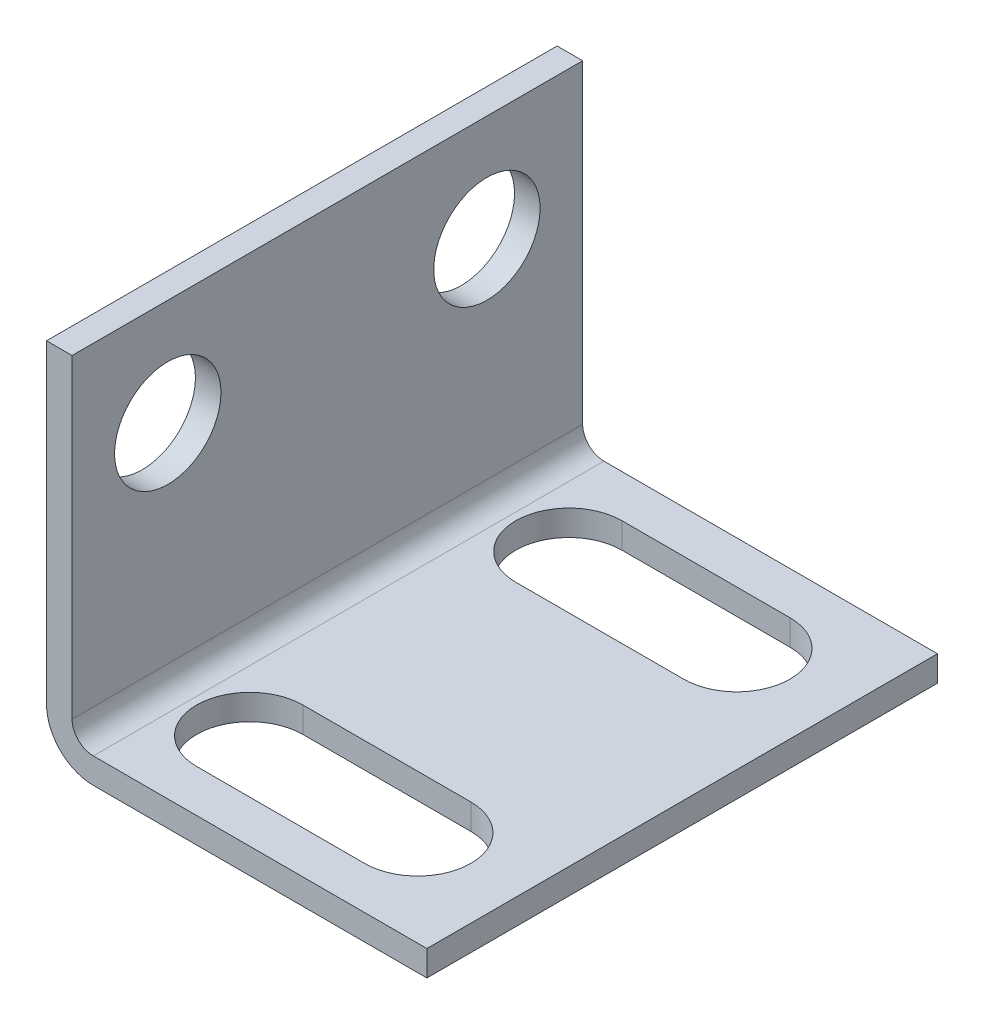
ISO-10303-21;
HEADER;
FILE_DESCRIPTION(('STEP AP214'),'2;1');
FILE_NAME('part.step','',(''),(''),'','','');
FILE_SCHEMA(('AUTOMOTIVE_DESIGN { 1 0 10303 214 1 1 1 1 }'));
ENDSEC;
DATA;
#1=APPLICATION_CONTEXT('core data for automotive mechanical design processes');
#2=APPLICATION_PROTOCOL_DEFINITION('international standard','automotive_design',2000,#1);
#3=PRODUCT_CONTEXT('',#1,'mechanical');
#4=PRODUCT('Part','Part','',(#3));
#5=PRODUCT_RELATED_PRODUCT_CATEGORY('part','',(#4));
#6=PRODUCT_DEFINITION_FORMATION('','',#4);
#7=PRODUCT_DEFINITION_CONTEXT('part definition',#1,'design');
#8=PRODUCT_DEFINITION('design','',#6,#7);
#9=PRODUCT_DEFINITION_SHAPE('','',#8);
#10=(LENGTH_UNIT() NAMED_UNIT(*) SI_UNIT(.MILLI.,.METRE.));
#11=(NAMED_UNIT(*) PLANE_ANGLE_UNIT() SI_UNIT($,.RADIAN.));
#12=(NAMED_UNIT(*) SI_UNIT($,.STERADIAN.) SOLID_ANGLE_UNIT());
#13=UNCERTAINTY_MEASURE_WITH_UNIT(LENGTH_MEASURE(1.E-05),#10,'distance_accuracy_value','');
#14=(GEOMETRIC_REPRESENTATION_CONTEXT(3) GLOBAL_UNCERTAINTY_ASSIGNED_CONTEXT((#13)) GLOBAL_UNIT_ASSIGNED_CONTEXT((#10,
#11,#12)) REPRESENTATION_CONTEXT('',''));
#15=CARTESIAN_POINT('',(0.,0.,0.));
#16=DIRECTION('',(0.,0.,1.));
#17=DIRECTION('',(1.,0.,0.));
#18=AXIS2_PLACEMENT_3D('',#15,#16,#17);
#19=CARTESIAN_POINT('',(1.2,0.,0.));
#20=DIRECTION('',(-1.,0.,0.));
#21=DIRECTION('',(0.,0.,1.));
#22=AXIS2_PLACEMENT_3D('',#19,#20,#21);
#23=PLANE('',#22);
#24=DIRECTION('',(0.,-1.,0.));
#25=VECTOR('',#24,1.);
#26=CARTESIAN_POINT('',(1.2,0.,0.));
#27=LINE('',#26,#25);
#28=CARTESIAN_POINT('',(1.2,17.,0.));
#29=VERTEX_POINT('',#28);
#30=CARTESIAN_POINT('',(1.2,2.2,0.));
#31=VERTEX_POINT('',#30);
#32=EDGE_CURVE('E254',#29,#31,#27,.T.);
#33=ORIENTED_EDGE('',*,*,#32,.T.);
#34=DIRECTION('',(0.,0.,-1.));
#35=VECTOR('',#34,1.);
#36=CARTESIAN_POINT('',(1.2,2.2,0.));
#37=LINE('',#36,#35);
#38=CARTESIAN_POINT('',(1.2,2.2,-24.));
#39=VERTEX_POINT('',#38);
#40=EDGE_CURVE('E272',#31,#39,#37,.T.);
#41=ORIENTED_EDGE('',*,*,#40,.T.);
#42=DIRECTION('',(0.,1.,0.));
#43=VECTOR('',#42,1.);
#44=CARTESIAN_POINT('',(1.2,17.,-24.));
#45=LINE('',#44,#43);
#46=CARTESIAN_POINT('',(1.2,17.,-24.));
#47=VERTEX_POINT('',#46);
#48=EDGE_CURVE('E249',#39,#47,#45,.T.);
#49=ORIENTED_EDGE('',*,*,#48,.T.);
#50=DIRECTION('',(0.,0.,1.));
#51=VECTOR('',#50,1.);
#52=CARTESIAN_POINT('',(1.2,17.,0.));
#53=LINE('',#52,#51);
#54=EDGE_CURVE('E251',#47,#29,#53,.T.);
#55=ORIENTED_EDGE('',*,*,#54,.T.);
#56=EDGE_LOOP('',(#33,#41,#49,#55));
#57=FACE_BOUND('',#56,.T.);
#58=CARTESIAN_POINT('',(1.2,12.,-4.5));
#59=DIRECTION('',(1.,0.,0.));
#60=DIRECTION('',(0.,0.,-1.));
#61=AXIS2_PLACEMENT_3D('',#58,#59,#60);
#62=CIRCLE('',#61,2.5);
#63=CARTESIAN_POINT('',(1.2,12.,-7.));
#64=VERTEX_POINT('',#63);
#65=EDGE_CURVE('E243',#64,#64,#62,.T.);
#66=ORIENTED_EDGE('',*,*,#65,.F.);
#67=EDGE_LOOP('',(#66));
#68=FACE_BOUND('',#67,.T.);
#69=CARTESIAN_POINT('',(1.2,12.,-19.5));
#70=DIRECTION('',(1.,0.,0.));
#71=DIRECTION('',(0.,0.,-1.));
#72=AXIS2_PLACEMENT_3D('',#69,#70,#71);
#73=CIRCLE('',#72,2.5);
#74=CARTESIAN_POINT('',(1.2,12.,-22.));
#75=VERTEX_POINT('',#74);
#76=EDGE_CURVE('E237',#75,#75,#73,.T.);
#77=ORIENTED_EDGE('',*,*,#76,.F.);
#78=EDGE_LOOP('',(#77));
#79=FACE_BOUND('',#78,.T.);
#80=ADVANCED_FACE('F34',(#57,#68,#79),#23,.F.);
#81=CARTESIAN_POINT('',(0.,0.,0.));
#82=DIRECTION('',(-1.,0.,0.));
#83=DIRECTION('',(0.,0.,1.));
#84=AXIS2_PLACEMENT_3D('',#81,#82,#83);
#85=PLANE('',#84);
#86=DIRECTION('',(0.,1.,0.));
#87=VECTOR('',#86,1.);
#88=CARTESIAN_POINT('',(0.,17.,-24.));
#89=LINE('',#88,#87);
#90=CARTESIAN_POINT('',(0.,2.20000000000001,-24.));
#91=VERTEX_POINT('',#90);
#92=CARTESIAN_POINT('',(0.,17.,-24.));
#93=VERTEX_POINT('',#92);
#94=EDGE_CURVE('E246',#91,#93,#89,.T.);
#95=ORIENTED_EDGE('',*,*,#94,.F.);
#96=DIRECTION('',(0.,0.,-1.));
#97=VECTOR('',#96,1.);
#98=CARTESIAN_POINT('',(0.,2.2,0.));
#99=LINE('',#98,#97);
#100=CARTESIAN_POINT('',(0.,2.2,0.));
#101=VERTEX_POINT('',#100);
#102=EDGE_CURVE('E42',#91,#101,#99,.F.);
#103=ORIENTED_EDGE('',*,*,#102,.T.);
#104=DIRECTION('',(0.,-1.,0.));
#105=VECTOR('',#104,1.);
#106=CARTESIAN_POINT('',(0.,0.,0.));
#107=LINE('',#106,#105);
#108=CARTESIAN_POINT('',(0.,17.,0.));
#109=VERTEX_POINT('',#108);
#110=EDGE_CURVE('E252',#109,#101,#107,.T.);
#111=ORIENTED_EDGE('',*,*,#110,.F.);
#112=DIRECTION('',(0.,0.,1.));
#113=VECTOR('',#112,1.);
#114=CARTESIAN_POINT('',(0.,17.,0.));
#115=LINE('',#114,#113);
#116=EDGE_CURVE('E259',#93,#109,#115,.T.);
#117=ORIENTED_EDGE('',*,*,#116,.F.);
#118=EDGE_LOOP('',(#95,#103,#111,#117));
#119=FACE_BOUND('',#118,.T.);
#120=CARTESIAN_POINT('',(0.,12.,-4.5));
#121=DIRECTION('',(1.,0.,0.));
#122=DIRECTION('',(0.,0.,-1.));
#123=AXIS2_PLACEMENT_3D('',#120,#121,#122);
#124=CIRCLE('',#123,2.5);
#125=CARTESIAN_POINT('',(0.,12.,-7.));
#126=VERTEX_POINT('',#125);
#127=EDGE_CURVE('E240',#126,#126,#124,.T.);
#128=ORIENTED_EDGE('',*,*,#127,.T.);
#129=EDGE_LOOP('',(#128));
#130=FACE_BOUND('',#129,.T.);
#131=CARTESIAN_POINT('',(0.,12.,-19.5));
#132=DIRECTION('',(1.,0.,0.));
#133=DIRECTION('',(0.,0.,-1.));
#134=AXIS2_PLACEMENT_3D('',#131,#132,#133);
#135=CIRCLE('',#134,2.5);
#136=CARTESIAN_POINT('',(0.,12.,-22.));
#137=VERTEX_POINT('',#136);
#138=EDGE_CURVE('E236',#137,#137,#135,.T.);
#139=ORIENTED_EDGE('',*,*,#138,.T.);
#140=EDGE_LOOP('',(#139));
#141=FACE_BOUND('',#140,.T.);
#142=ADVANCED_FACE('F310',(#119,#130,#141),#85,.T.);
#143=CARTESIAN_POINT('',(1.2,0.,-24.));
#144=DIRECTION('',(0.,1.,0.));
#145=DIRECTION('',(0.,0.,1.));
#146=AXIS2_PLACEMENT_3D('',#143,#144,#145);
#147=PLANE('',#146);
#148=DIRECTION('',(-1.,0.,0.));
#149=VECTOR('',#148,1.);
#150=CARTESIAN_POINT('',(1.2,0.,0.));
#151=LINE('',#150,#149);
#152=CARTESIAN_POINT('',(17.88,0.,0.));
#153=VERTEX_POINT('',#152);
#154=CARTESIAN_POINT('',(2.2,0.,0.));
#155=VERTEX_POINT('',#154);
#156=EDGE_CURVE('E257',#153,#155,#151,.T.);
#157=ORIENTED_EDGE('',*,*,#156,.T.);
#158=DIRECTION('',(0.,0.,-1.));
#159=VECTOR('',#158,1.);
#160=CARTESIAN_POINT('',(2.2,0.,-24.));
#161=LINE('',#160,#159);
#162=CARTESIAN_POINT('',(2.2,0.,-24.));
#163=VERTEX_POINT('',#162);
#164=EDGE_CURVE('E281',#155,#163,#161,.T.);
#165=ORIENTED_EDGE('',*,*,#164,.T.);
#166=DIRECTION('',(-1.,0.,0.));
#167=VECTOR('',#166,1.);
#168=CARTESIAN_POINT('',(1.2,0.,-24.));
#169=LINE('',#168,#167);
#170=CARTESIAN_POINT('',(17.88,0.,-24.));
#171=VERTEX_POINT('',#170);
#172=EDGE_CURVE('E270',#171,#163,#169,.T.);
#173=ORIENTED_EDGE('',*,*,#172,.F.);
#174=DIRECTION('',(0.,0.,-1.));
#175=VECTOR('',#174,1.);
#176=CARTESIAN_POINT('',(17.88,0.,0.));
#177=LINE('',#176,#175);
#178=EDGE_CURVE('E220',#153,#171,#177,.T.);
#179=ORIENTED_EDGE('',*,*,#178,.F.);
#180=EDGE_LOOP('',(#157,#165,#173,#179));
#181=FACE_BOUND('',#180,.T.);
#182=CARTESIAN_POINT('',(5.05275831629409,0.,-19.5));
#183=DIRECTION('',(0.,1.,0.));
#184=DIRECTION('',(0.,0.,1.));
#185=AXIS2_PLACEMENT_3D('',#182,#183,#184);
#186=CIRCLE('',#185,2.5);
#187=CARTESIAN_POINT('',(5.05275831629409,0.,-22.));
#188=VERTEX_POINT('',#187);
#189=CARTESIAN_POINT('',(5.05275831629409,0.,-17.));
#190=VERTEX_POINT('',#189);
#191=EDGE_CURVE('E165',#188,#190,#186,.T.);
#192=ORIENTED_EDGE('',*,*,#191,.T.);
#193=DIRECTION('',(1.,0.,0.));
#194=VECTOR('',#193,1.);
#195=CARTESIAN_POINT('',(5.05275831629409,0.,-17.));
#196=LINE('',#195,#194);
#197=CARTESIAN_POINT('',(12.9472416837059,0.,-17.));
#198=VERTEX_POINT('',#197);
#199=EDGE_CURVE('E203',#190,#198,#196,.T.);
#200=ORIENTED_EDGE('',*,*,#199,.T.);
#201=CARTESIAN_POINT('',(12.9472416837059,0.,-19.5));
#202=DIRECTION('',(0.,1.,0.));
#203=DIRECTION('',(0.,0.,1.));
#204=AXIS2_PLACEMENT_3D('',#201,#202,#203);
#205=CIRCLE('',#204,2.5);
#206=CARTESIAN_POINT('',(12.9472416837059,0.,-22.));
#207=VERTEX_POINT('',#206);
#208=EDGE_CURVE('E206',#198,#207,#205,.T.);
#209=ORIENTED_EDGE('',*,*,#208,.T.);
#210=DIRECTION('',(-1.,0.,0.));
#211=VECTOR('',#210,1.);
#212=CARTESIAN_POINT('',(5.05275831629409,0.,-22.));
#213=LINE('',#212,#211);
#214=EDGE_CURVE('E193',#207,#188,#213,.T.);
#215=ORIENTED_EDGE('',*,*,#214,.T.);
#216=EDGE_LOOP('',(#192,#200,#209,#215));
#217=FACE_BOUND('',#216,.T.);
#218=CARTESIAN_POINT('',(5.05275831629409,0.,-4.5));
#219=DIRECTION('',(0.,1.,0.));
#220=DIRECTION('',(0.,0.,1.));
#221=AXIS2_PLACEMENT_3D('',#218,#219,#220);
#222=CIRCLE('',#221,2.5);
#223=CARTESIAN_POINT('',(5.05275831629409,0.,-7.));
#224=VERTEX_POINT('',#223);
#225=CARTESIAN_POINT('',(5.05275831629409,0.,-2.));
#226=VERTEX_POINT('',#225);
#227=EDGE_CURVE('E178',#224,#226,#222,.T.);
#228=ORIENTED_EDGE('',*,*,#227,.T.);
#229=DIRECTION('',(1.,0.,0.));
#230=VECTOR('',#229,1.);
#231=CARTESIAN_POINT('',(5.05275831629409,0.,-2.));
#232=LINE('',#231,#230);
#233=CARTESIAN_POINT('',(12.9472416837059,0.,-2.));
#234=VERTEX_POINT('',#233);
#235=EDGE_CURVE('E164',#226,#234,#232,.T.);
#236=ORIENTED_EDGE('',*,*,#235,.T.);
#237=CARTESIAN_POINT('',(12.9472416837059,0.,-4.5));
#238=DIRECTION('',(0.,1.,0.));
#239=DIRECTION('',(0.,0.,1.));
#240=AXIS2_PLACEMENT_3D('',#237,#238,#239);
#241=CIRCLE('',#240,2.5);
#242=CARTESIAN_POINT('',(12.9472416837059,0.,-7.));
#243=VERTEX_POINT('',#242);
#244=EDGE_CURVE('E181',#234,#243,#241,.T.);
#245=ORIENTED_EDGE('',*,*,#244,.T.);
#246=DIRECTION('',(-1.,0.,0.));
#247=VECTOR('',#246,1.);
#248=CARTESIAN_POINT('',(5.05275831629409,0.,-7.));
#249=LINE('',#248,#247);
#250=EDGE_CURVE('E158',#243,#224,#249,.T.);
#251=ORIENTED_EDGE('',*,*,#250,.T.);
#252=EDGE_LOOP('',(#228,#236,#245,#251));
#253=FACE_BOUND('',#252,.T.);
#254=ADVANCED_FACE('F286',(#181,#217,#253),#147,.F.);
#255=CARTESIAN_POINT('',(1.2,17.,-24.));
#256=DIRECTION('',(0.,0.,1.));
#257=DIRECTION('',(1.,0.,0.));
#258=AXIS2_PLACEMENT_3D('',#255,#256,#257);
#259=PLANE('',#258);
#260=ORIENTED_EDGE('',*,*,#172,.T.);
#261=CARTESIAN_POINT('',(2.2,2.20000000000001,-24.));
#262=DIRECTION('',(0.,0.,1.));
#263=DIRECTION('',(1.,0.,0.));
#264=AXIS2_PLACEMENT_3D('',#261,#262,#263);
#265=CIRCLE('',#264,2.2);
#266=EDGE_CURVE('E56',#163,#91,#265,.F.);
#267=ORIENTED_EDGE('',*,*,#266,.T.);
#268=ORIENTED_EDGE('',*,*,#94,.T.);
#269=DIRECTION('',(-1.,0.,0.));
#270=VECTOR('',#269,1.);
#271=CARTESIAN_POINT('',(1.2,17.,-24.));
#272=LINE('',#271,#270);
#273=EDGE_CURVE('E267',#47,#93,#272,.T.);
#274=ORIENTED_EDGE('',*,*,#273,.F.);
#275=ORIENTED_EDGE('',*,*,#48,.F.);
#276=CARTESIAN_POINT('',(2.2,2.2,-24.));
#277=DIRECTION('',(0.,0.,1.));
#278=DIRECTION('',(1.,0.,0.));
#279=AXIS2_PLACEMENT_3D('',#276,#277,#278);
#280=CIRCLE('',#279,1.);
#281=CARTESIAN_POINT('',(2.2,1.2,-24.));
#282=VERTEX_POINT('',#281);
#283=EDGE_CURVE('E277',#39,#282,#280,.T.);
#284=ORIENTED_EDGE('',*,*,#283,.T.);
#285=DIRECTION('',(-1.,0.,0.));
#286=VECTOR('',#285,1.);
#287=CARTESIAN_POINT('',(17.88,1.2,-24.));
#288=LINE('',#287,#286);
#289=CARTESIAN_POINT('',(17.88,1.2,-24.));
#290=VERTEX_POINT('',#289);
#291=EDGE_CURVE('E221',#290,#282,#288,.T.);
#292=ORIENTED_EDGE('',*,*,#291,.F.);
#293=DIRECTION('',(0.,-1.,0.));
#294=VECTOR('',#293,1.);
#295=CARTESIAN_POINT('',(17.88,1.2,-24.));
#296=LINE('',#295,#294);
#297=EDGE_CURVE('E228',#290,#171,#296,.T.);
#298=ORIENTED_EDGE('',*,*,#297,.T.);
#299=EDGE_LOOP('',(#260,#267,#268,#274,#275,#284,#292,#298));
#300=FACE_BOUND('',#299,.T.);
#301=ADVANCED_FACE('F291',(#300),#259,.F.);
#302=CARTESIAN_POINT('',(1.2,17.,0.));
#303=DIRECTION('',(0.,-1.,0.));
#304=DIRECTION('',(0.,0.,-1.));
#305=AXIS2_PLACEMENT_3D('',#302,#303,#304);
#306=PLANE('',#305);
#307=ORIENTED_EDGE('',*,*,#116,.T.);
#308=DIRECTION('',(-1.,0.,0.));
#309=VECTOR('',#308,1.);
#310=CARTESIAN_POINT('',(1.2,17.,0.));
#311=LINE('',#310,#309);
#312=EDGE_CURVE('E264',#29,#109,#311,.T.);
#313=ORIENTED_EDGE('',*,*,#312,.F.);
#314=ORIENTED_EDGE('',*,*,#54,.F.);
#315=ORIENTED_EDGE('',*,*,#273,.T.);
#316=EDGE_LOOP('',(#307,#313,#314,#315));
#317=FACE_BOUND('',#316,.T.);
#318=ADVANCED_FACE('F324',(#317),#306,.F.);
#319=CARTESIAN_POINT('',(1.2,0.,0.));
#320=DIRECTION('',(0.,0.,-1.));
#321=DIRECTION('',(-1.,0.,0.));
#322=AXIS2_PLACEMENT_3D('',#319,#320,#321);
#323=PLANE('',#322);
#324=ORIENTED_EDGE('',*,*,#110,.T.);
#325=CARTESIAN_POINT('',(2.2,2.2,0.));
#326=DIRECTION('',(0.,0.,-1.));
#327=DIRECTION('',(-1.,0.,0.));
#328=AXIS2_PLACEMENT_3D('',#325,#326,#327);
#329=CIRCLE('',#328,2.2);
#330=EDGE_CURVE('E11',#101,#155,#329,.F.);
#331=ORIENTED_EDGE('',*,*,#330,.T.);
#332=ORIENTED_EDGE('',*,*,#156,.F.);
#333=DIRECTION('',(0.,-1.,0.));
#334=VECTOR('',#333,1.);
#335=CARTESIAN_POINT('',(17.88,1.2,0.));
#336=LINE('',#335,#334);
#337=CARTESIAN_POINT('',(17.88,1.2,0.));
#338=VERTEX_POINT('',#337);
#339=EDGE_CURVE('E233',#338,#153,#336,.T.);
#340=ORIENTED_EDGE('',*,*,#339,.F.);
#341=DIRECTION('',(1.,0.,0.));
#342=VECTOR('',#341,1.);
#343=CARTESIAN_POINT('',(0.,1.2,0.));
#344=LINE('',#343,#342);
#345=CARTESIAN_POINT('',(2.2,1.2,0.));
#346=VERTEX_POINT('',#345);
#347=EDGE_CURVE('E224',#346,#338,#344,.T.);
#348=ORIENTED_EDGE('',*,*,#347,.F.);
#349=CARTESIAN_POINT('',(2.2,2.2,0.));
#350=DIRECTION('',(0.,0.,-1.));
#351=DIRECTION('',(-1.,0.,0.));
#352=AXIS2_PLACEMENT_3D('',#349,#350,#351);
#353=CIRCLE('',#352,1.);
#354=EDGE_CURVE('E279',#346,#31,#353,.T.);
#355=ORIENTED_EDGE('',*,*,#354,.T.);
#356=ORIENTED_EDGE('',*,*,#32,.F.);
#357=ORIENTED_EDGE('',*,*,#312,.T.);
#358=EDGE_LOOP('',(#324,#331,#332,#340,#348,#355,#356,#357));
#359=FACE_BOUND('',#358,.T.);
#360=ADVANCED_FACE('F300',(#359),#323,.F.);
#361=CARTESIAN_POINT('',(1.2,12.,-4.5));
#362=DIRECTION('',(-1.,0.,0.));
#363=DIRECTION('',(0.,0.,1.));
#364=AXIS2_PLACEMENT_3D('',#361,#362,#363);
#365=CYLINDRICAL_SURFACE('',#364,2.5);
#366=ORIENTED_EDGE('',*,*,#65,.T.);
#367=EDGE_LOOP('',(#366));
#368=FACE_BOUND('',#367,.T.);
#369=ORIENTED_EDGE('',*,*,#127,.F.);
#370=EDGE_LOOP('',(#369));
#371=FACE_BOUND('',#370,.T.);
#372=ADVANCED_FACE('F319',(#368,#371),#365,.F.);
#373=CARTESIAN_POINT('',(1.2,12.,-19.5));
#374=DIRECTION('',(-1.,0.,0.));
#375=DIRECTION('',(0.,0.,1.));
#376=AXIS2_PLACEMENT_3D('',#373,#374,#375);
#377=CYLINDRICAL_SURFACE('',#376,2.5);
#378=ORIENTED_EDGE('',*,*,#76,.T.);
#379=EDGE_LOOP('',(#378));
#380=FACE_BOUND('',#379,.T.);
#381=ORIENTED_EDGE('',*,*,#138,.F.);
#382=EDGE_LOOP('',(#381));
#383=FACE_BOUND('',#382,.T.);
#384=ADVANCED_FACE('F353',(#380,#383),#377,.F.);
#385=CARTESIAN_POINT('',(0.,1.2,0.));
#386=DIRECTION('',(0.,1.,0.));
#387=DIRECTION('',(0.,0.,1.));
#388=AXIS2_PLACEMENT_3D('',#385,#386,#387);
#389=PLANE('',#388);
#390=DIRECTION('',(1.,0.,0.));
#391=VECTOR('',#390,1.);
#392=CARTESIAN_POINT('',(5.05275831629409,1.2,-2.));
#393=LINE('',#392,#391);
#394=CARTESIAN_POINT('',(5.05275831629409,1.2,-2.));
#395=VERTEX_POINT('',#394);
#396=CARTESIAN_POINT('',(12.9472416837059,1.2,-2.));
#397=VERTEX_POINT('',#396);
#398=EDGE_CURVE('E157',#395,#397,#393,.T.);
#399=ORIENTED_EDGE('',*,*,#398,.F.);
#400=CARTESIAN_POINT('',(5.05275831629409,1.2,-4.5));
#401=DIRECTION('',(0.,1.,0.));
#402=DIRECTION('',(0.,0.,1.));
#403=AXIS2_PLACEMENT_3D('',#400,#401,#402);
#404=CIRCLE('',#403,2.5);
#405=CARTESIAN_POINT('',(5.05275831629409,1.2,-7.));
#406=VERTEX_POINT('',#405);
#407=EDGE_CURVE('E147',#406,#395,#404,.T.);
#408=ORIENTED_EDGE('',*,*,#407,.F.);
#409=DIRECTION('',(-1.,0.,0.));
#410=VECTOR('',#409,1.);
#411=CARTESIAN_POINT('',(5.05275831629409,1.2,-7.));
#412=LINE('',#411,#410);
#413=CARTESIAN_POINT('',(12.9472416837059,1.2,-7.));
#414=VERTEX_POINT('',#413);
#415=EDGE_CURVE('E174',#414,#406,#412,.T.);
#416=ORIENTED_EDGE('',*,*,#415,.F.);
#417=CARTESIAN_POINT('',(12.9472416837059,1.2,-4.5));
#418=DIRECTION('',(0.,1.,0.));
#419=DIRECTION('',(0.,0.,1.));
#420=AXIS2_PLACEMENT_3D('',#417,#418,#419);
#421=CIRCLE('',#420,2.5);
#422=EDGE_CURVE('E172',#397,#414,#421,.T.);
#423=ORIENTED_EDGE('',*,*,#422,.F.);
#424=EDGE_LOOP('',(#399,#408,#416,#423));
#425=FACE_BOUND('',#424,.T.);
#426=DIRECTION('',(1.,0.,0.));
#427=VECTOR('',#426,1.);
#428=CARTESIAN_POINT('',(5.05275831629409,1.2,-17.));
#429=LINE('',#428,#427);
#430=CARTESIAN_POINT('',(5.05275831629409,1.2,-17.));
#431=VERTEX_POINT('',#430);
#432=CARTESIAN_POINT('',(12.9472416837059,1.2,-17.));
#433=VERTEX_POINT('',#432);
#434=EDGE_CURVE('E192',#431,#433,#429,.T.);
#435=ORIENTED_EDGE('',*,*,#434,.F.);
#436=CARTESIAN_POINT('',(5.05275831629409,1.2,-19.5));
#437=DIRECTION('',(0.,1.,0.));
#438=DIRECTION('',(0.,0.,1.));
#439=AXIS2_PLACEMENT_3D('',#436,#437,#438);
#440=CIRCLE('',#439,2.5);
#441=CARTESIAN_POINT('',(5.05275831629409,1.2,-22.));
#442=VERTEX_POINT('',#441);
#443=EDGE_CURVE('E190',#442,#431,#440,.T.);
#444=ORIENTED_EDGE('',*,*,#443,.F.);
#445=DIRECTION('',(-1.,0.,0.));
#446=VECTOR('',#445,1.);
#447=CARTESIAN_POINT('',(5.05275831629409,1.2,-22.));
#448=LINE('',#447,#446);
#449=CARTESIAN_POINT('',(12.9472416837059,1.2,-22.));
#450=VERTEX_POINT('',#449);
#451=EDGE_CURVE('E198',#450,#442,#448,.T.);
#452=ORIENTED_EDGE('',*,*,#451,.F.);
#453=CARTESIAN_POINT('',(12.9472416837059,1.2,-19.5));
#454=DIRECTION('',(0.,1.,0.));
#455=DIRECTION('',(0.,0.,1.));
#456=AXIS2_PLACEMENT_3D('',#453,#454,#455);
#457=CIRCLE('',#456,2.5);
#458=EDGE_CURVE('E195',#433,#450,#457,.T.);
#459=ORIENTED_EDGE('',*,*,#458,.F.);
#460=EDGE_LOOP('',(#435,#444,#452,#459));
#461=FACE_BOUND('',#460,.T.);
#462=ORIENTED_EDGE('',*,*,#291,.T.);
#463=DIRECTION('',(0.,0.,-1.));
#464=VECTOR('',#463,1.);
#465=CARTESIAN_POINT('',(2.2,1.2,0.));
#466=LINE('',#465,#464);
#467=EDGE_CURVE('E275',#282,#346,#466,.F.);
#468=ORIENTED_EDGE('',*,*,#467,.T.);
#469=ORIENTED_EDGE('',*,*,#347,.T.);
#470=DIRECTION('',(0.,0.,-1.));
#471=VECTOR('',#470,1.);
#472=CARTESIAN_POINT('',(17.88,1.2,0.));
#473=LINE('',#472,#471);
#474=EDGE_CURVE('E226',#338,#290,#473,.T.);
#475=ORIENTED_EDGE('',*,*,#474,.T.);
#476=EDGE_LOOP('',(#462,#468,#469,#475));
#477=FACE_BOUND('',#476,.T.);
#478=ADVANCED_FACE('F169',(#425,#461,#477),#389,.T.);
#479=CARTESIAN_POINT('',(17.88,1.2,0.));
#480=DIRECTION('',(-1.,0.,0.));
#481=DIRECTION('',(0.,0.,1.));
#482=AXIS2_PLACEMENT_3D('',#479,#480,#481);
#483=PLANE('',#482);
#484=ORIENTED_EDGE('',*,*,#178,.T.);
#485=ORIENTED_EDGE('',*,*,#297,.F.);
#486=ORIENTED_EDGE('',*,*,#474,.F.);
#487=ORIENTED_EDGE('',*,*,#339,.T.);
#488=EDGE_LOOP('',(#484,#485,#486,#487));
#489=FACE_BOUND('',#488,.T.);
#490=ADVANCED_FACE('F296',(#489),#483,.F.);
#491=CARTESIAN_POINT('',(5.05275831629409,1.2,-19.5));
#492=DIRECTION('',(0.,-1.,0.));
#493=DIRECTION('',(0.,0.,-1.));
#494=AXIS2_PLACEMENT_3D('',#491,#492,#493);
#495=CYLINDRICAL_SURFACE('',#494,2.5);
#496=ORIENTED_EDGE('',*,*,#191,.F.);
#497=DIRECTION('',(0.,-1.,0.));
#498=VECTOR('',#497,1.);
#499=CARTESIAN_POINT('',(5.05275831629409,1.2,-22.));
#500=LINE('',#499,#498);
#501=EDGE_CURVE('E200',#442,#188,#500,.T.);
#502=ORIENTED_EDGE('',*,*,#501,.F.);
#503=ORIENTED_EDGE('',*,*,#443,.T.);
#504=DIRECTION('',(0.,-1.,0.));
#505=VECTOR('',#504,1.);
#506=CARTESIAN_POINT('',(5.05275831629409,1.2,-17.));
#507=LINE('',#506,#505);
#508=EDGE_CURVE('E217',#431,#190,#507,.T.);
#509=ORIENTED_EDGE('',*,*,#508,.T.);
#510=EDGE_LOOP('',(#496,#502,#503,#509));
#511=FACE_BOUND('',#510,.T.);
#512=ADVANCED_FACE('F373',(#511),#495,.F.);
#513=CARTESIAN_POINT('',(5.05275831629409,1.2,-17.));
#514=DIRECTION('',(0.,0.,-1.));
#515=DIRECTION('',(-1.,0.,0.));
#516=AXIS2_PLACEMENT_3D('',#513,#514,#515);
#517=PLANE('',#516);
#518=ORIENTED_EDGE('',*,*,#199,.F.);
#519=ORIENTED_EDGE('',*,*,#508,.F.);
#520=ORIENTED_EDGE('',*,*,#434,.T.);
#521=DIRECTION('',(0.,-1.,0.));
#522=VECTOR('',#521,1.);
#523=CARTESIAN_POINT('',(12.9472416837059,1.2,-17.));
#524=LINE('',#523,#522);
#525=EDGE_CURVE('E215',#433,#198,#524,.T.);
#526=ORIENTED_EDGE('',*,*,#525,.T.);
#527=EDGE_LOOP('',(#518,#519,#520,#526));
#528=FACE_BOUND('',#527,.T.);
#529=ADVANCED_FACE('F380',(#528),#517,.T.);
#530=CARTESIAN_POINT('',(12.9472416837059,1.2,-19.5));
#531=DIRECTION('',(0.,-1.,0.));
#532=DIRECTION('',(0.,0.,-1.));
#533=AXIS2_PLACEMENT_3D('',#530,#531,#532);
#534=CYLINDRICAL_SURFACE('',#533,2.5);
#535=ORIENTED_EDGE('',*,*,#208,.F.);
#536=ORIENTED_EDGE('',*,*,#525,.F.);
#537=ORIENTED_EDGE('',*,*,#458,.T.);
#538=DIRECTION('',(0.,-1.,0.));
#539=VECTOR('',#538,1.);
#540=CARTESIAN_POINT('',(12.9472416837059,1.2,-22.));
#541=LINE('',#540,#539);
#542=EDGE_CURVE('E213',#450,#207,#541,.T.);
#543=ORIENTED_EDGE('',*,*,#542,.T.);
#544=EDGE_LOOP('',(#535,#536,#537,#543));
#545=FACE_BOUND('',#544,.T.);
#546=ADVANCED_FACE('F388',(#545),#534,.F.);
#547=CARTESIAN_POINT('',(5.05275831629409,1.2,-22.));
#548=DIRECTION('',(0.,0.,1.));
#549=DIRECTION('',(1.,0.,0.));
#550=AXIS2_PLACEMENT_3D('',#547,#548,#549);
#551=PLANE('',#550);
#552=ORIENTED_EDGE('',*,*,#214,.F.);
#553=ORIENTED_EDGE('',*,*,#542,.F.);
#554=ORIENTED_EDGE('',*,*,#451,.T.);
#555=ORIENTED_EDGE('',*,*,#501,.T.);
#556=EDGE_LOOP('',(#552,#553,#554,#555));
#557=FACE_BOUND('',#556,.T.);
#558=ADVANCED_FACE('F396',(#557),#551,.T.);
#559=CARTESIAN_POINT('',(5.05275831629409,1.2,-4.5));
#560=DIRECTION('',(0.,-1.,0.));
#561=DIRECTION('',(0.,0.,-1.));
#562=AXIS2_PLACEMENT_3D('',#559,#560,#561);
#563=CYLINDRICAL_SURFACE('',#562,2.5);
#564=ORIENTED_EDGE('',*,*,#227,.F.);
#565=DIRECTION('',(0.,-1.,0.));
#566=VECTOR('',#565,1.);
#567=CARTESIAN_POINT('',(5.05275831629409,1.2,-7.));
#568=LINE('',#567,#566);
#569=EDGE_CURVE('E153',#406,#224,#568,.T.);
#570=ORIENTED_EDGE('',*,*,#569,.F.);
#571=ORIENTED_EDGE('',*,*,#407,.T.);
#572=DIRECTION('',(0.,-1.,0.));
#573=VECTOR('',#572,1.);
#574=CARTESIAN_POINT('',(5.05275831629409,1.2,-2.));
#575=LINE('',#574,#573);
#576=EDGE_CURVE('E150',#395,#226,#575,.T.);
#577=ORIENTED_EDGE('',*,*,#576,.T.);
#578=EDGE_LOOP('',(#564,#570,#571,#577));
#579=FACE_BOUND('',#578,.T.);
#580=ADVANCED_FACE('F149',(#579),#563,.F.);
#581=CARTESIAN_POINT('',(5.05275831629409,1.2,-2.));
#582=DIRECTION('',(0.,0.,-1.));
#583=DIRECTION('',(-1.,0.,0.));
#584=AXIS2_PLACEMENT_3D('',#581,#582,#583);
#585=PLANE('',#584);
#586=ORIENTED_EDGE('',*,*,#235,.F.);
#587=ORIENTED_EDGE('',*,*,#576,.F.);
#588=ORIENTED_EDGE('',*,*,#398,.T.);
#589=DIRECTION('',(0.,-1.,0.));
#590=VECTOR('',#589,1.);
#591=CARTESIAN_POINT('',(12.9472416837059,1.2,-2.));
#592=LINE('',#591,#590);
#593=EDGE_CURVE('E166',#397,#234,#592,.T.);
#594=ORIENTED_EDGE('',*,*,#593,.T.);
#595=EDGE_LOOP('',(#586,#587,#588,#594));
#596=FACE_BOUND('',#595,.T.);
#597=ADVANCED_FACE('F161',(#596),#585,.T.);
#598=CARTESIAN_POINT('',(12.9472416837059,1.2,-4.5));
#599=DIRECTION('',(0.,-1.,0.));
#600=DIRECTION('',(0.,0.,-1.));
#601=AXIS2_PLACEMENT_3D('',#598,#599,#600);
#602=CYLINDRICAL_SURFACE('',#601,2.5);
#603=ORIENTED_EDGE('',*,*,#244,.F.);
#604=ORIENTED_EDGE('',*,*,#593,.F.);
#605=ORIENTED_EDGE('',*,*,#422,.T.);
#606=DIRECTION('',(0.,-1.,0.));
#607=VECTOR('',#606,1.);
#608=CARTESIAN_POINT('',(12.9472416837059,1.2,-7.));
#609=LINE('',#608,#607);
#610=EDGE_CURVE('E187',#414,#243,#609,.T.);
#611=ORIENTED_EDGE('',*,*,#610,.T.);
#612=EDGE_LOOP('',(#603,#604,#605,#611));
#613=FACE_BOUND('',#612,.T.);
#614=ADVANCED_FACE('F417',(#613),#602,.F.);
#615=CARTESIAN_POINT('',(5.05275831629409,1.2,-7.));
#616=DIRECTION('',(0.,0.,1.));
#617=DIRECTION('',(1.,0.,0.));
#618=AXIS2_PLACEMENT_3D('',#615,#616,#617);
#619=PLANE('',#618);
#620=ORIENTED_EDGE('',*,*,#250,.F.);
#621=ORIENTED_EDGE('',*,*,#610,.F.);
#622=ORIENTED_EDGE('',*,*,#415,.T.);
#623=ORIENTED_EDGE('',*,*,#569,.T.);
#624=EDGE_LOOP('',(#620,#621,#622,#623));
#625=FACE_BOUND('',#624,.T.);
#626=ADVANCED_FACE('F307',(#625),#619,.T.);
#627=CARTESIAN_POINT('',(2.2,2.2,0.));
#628=DIRECTION('',(0.,0.,-1.));
#629=DIRECTION('',(-1.,0.,0.));
#630=AXIS2_PLACEMENT_3D('',#627,#628,#629);
#631=CYLINDRICAL_SURFACE('',#630,1.);
#632=ORIENTED_EDGE('',*,*,#354,.F.);
#633=ORIENTED_EDGE('',*,*,#467,.F.);
#634=ORIENTED_EDGE('',*,*,#283,.F.);
#635=ORIENTED_EDGE('',*,*,#40,.F.);
#636=EDGE_LOOP('',(#632,#633,#634,#635));
#637=FACE_BOUND('',#636,.T.);
#638=ADVANCED_FACE('F303',(#637),#631,.F.);
#639=CARTESIAN_POINT('',(2.2,2.20000000000001,-24.));
#640=DIRECTION('',(0.,0.,1.));
#641=DIRECTION('',(0.,-1.,0.));
#642=AXIS2_PLACEMENT_3D('',#639,#640,#641);
#643=CYLINDRICAL_SURFACE('',#642,2.2);
#644=ORIENTED_EDGE('',*,*,#330,.F.);
#645=ORIENTED_EDGE('',*,*,#102,.F.);
#646=ORIENTED_EDGE('',*,*,#266,.F.);
#647=ORIENTED_EDGE('',*,*,#164,.F.);
#648=EDGE_LOOP('',(#644,#645,#646,#647));
#649=FACE_BOUND('',#648,.T.);
#650=ADVANCED_FACE('F36',(#649),#643,.T.);
#651=CLOSED_SHELL('',(#80,#142,#254,#301,#318,#360,#372,#384,#478,#490,#512,#529,#546,#558,#580,
#597,#614,#626,#638,#650));
#652=MANIFOLD_SOLID_BREP('B2',#651);
#653=ADVANCED_BREP_SHAPE_REPRESENTATION('',(#18,#652),#14);
#654=SHAPE_DEFINITION_REPRESENTATION(#9,#653);
ENDSEC;
END-ISO-10303-21;
